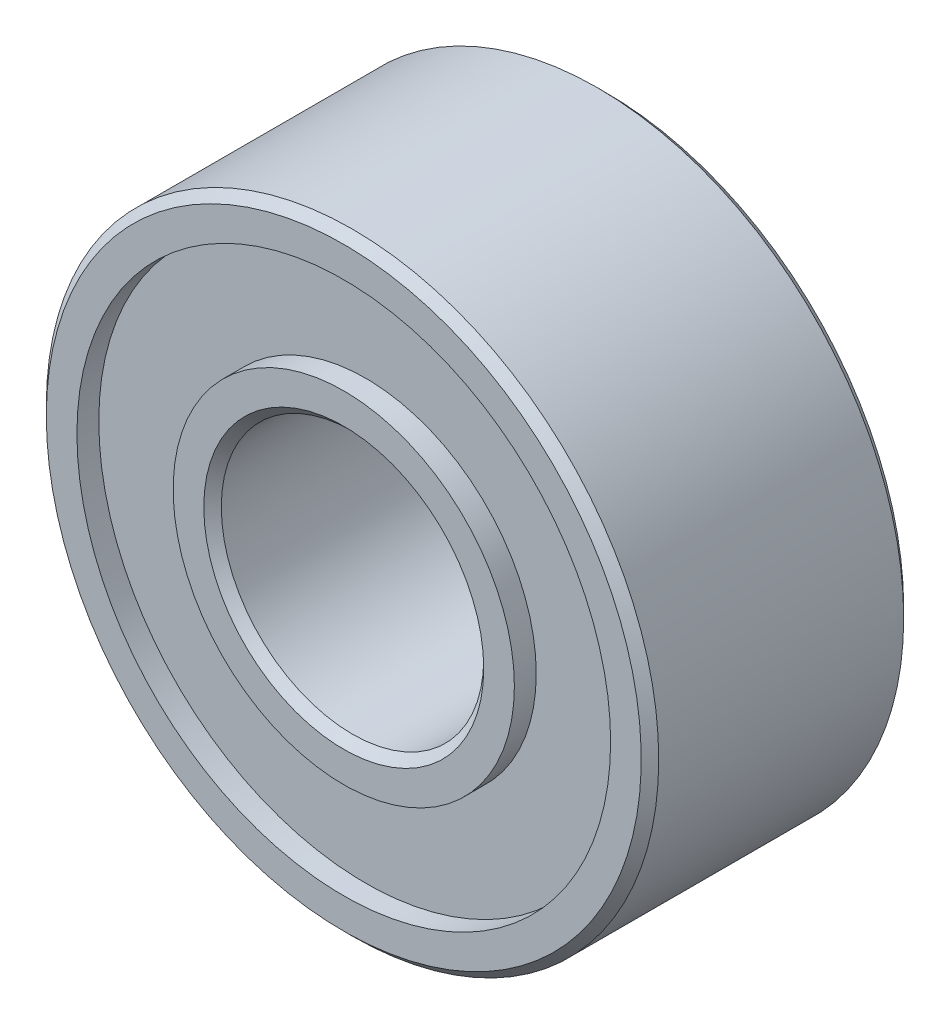
ISO-10303-21;
HEADER;
FILE_DESCRIPTION(('STEP AP214'),'2;1');
FILE_NAME('part.step','',(''),(''),'','','');
FILE_SCHEMA(('AUTOMOTIVE_DESIGN { 1 0 10303 214 1 1 1 1 }'));
ENDSEC;
DATA;
#1=APPLICATION_CONTEXT('core data for automotive mechanical design processes');
#2=APPLICATION_PROTOCOL_DEFINITION('international standard','automotive_design',2000,#1);
#3=PRODUCT_CONTEXT('',#1,'mechanical');
#4=PRODUCT('Part','Part','',(#3));
#5=PRODUCT_RELATED_PRODUCT_CATEGORY('part','',(#4));
#6=PRODUCT_DEFINITION_FORMATION('','',#4);
#7=PRODUCT_DEFINITION_CONTEXT('part definition',#1,'design');
#8=PRODUCT_DEFINITION('design','',#6,#7);
#9=PRODUCT_DEFINITION_SHAPE('','',#8);
#10=(LENGTH_UNIT() NAMED_UNIT(*) SI_UNIT(.MILLI.,.METRE.));
#11=(NAMED_UNIT(*) PLANE_ANGLE_UNIT() SI_UNIT($,.RADIAN.));
#12=(NAMED_UNIT(*) SI_UNIT($,.STERADIAN.) SOLID_ANGLE_UNIT());
#13=UNCERTAINTY_MEASURE_WITH_UNIT(LENGTH_MEASURE(1.E-05),#10,'distance_accuracy_value','');
#14=(GEOMETRIC_REPRESENTATION_CONTEXT(3) GLOBAL_UNCERTAINTY_ASSIGNED_CONTEXT((#13)) GLOBAL_UNIT_ASSIGNED_CONTEXT((#10,
#11,#12)) REPRESENTATION_CONTEXT('',''));
#15=CARTESIAN_POINT('',(0.,0.,0.));
#16=DIRECTION('',(0.,0.,1.));
#17=DIRECTION('',(1.,0.,0.));
#18=AXIS2_PLACEMENT_3D('',#15,#16,#17);
#19=CARTESIAN_POINT('',(0.,1.5,-1.5));
#20=DIRECTION('',(0.,0.,1.));
#21=DIRECTION('',(1.,0.,0.));
#22=AXIS2_PLACEMENT_3D('',#19,#20,#21);
#23=PLANE('',#22);
#24=CARTESIAN_POINT('',(0.,0.,-1.5));
#25=DIRECTION('',(0.,0.,1.));
#26=DIRECTION('',(1.,0.,0.));
#27=AXIS2_PLACEMENT_3D('',#24,#25,#26);
#28=CIRCLE('',#27,1.6);
#29=CARTESIAN_POINT('',(1.6,0.,-1.5));
#30=VERTEX_POINT('',#29);
#31=EDGE_CURVE('E66',#30,#30,#28,.T.);
#32=ORIENTED_EDGE('',*,*,#31,.T.);
#33=EDGE_LOOP('',(#32));
#34=FACE_BOUND('',#33,.T.);
#35=CARTESIAN_POINT('',(0.,0.,-1.5));
#36=DIRECTION('',(0.,0.,1.));
#37=DIRECTION('',(1.,0.,0.));
#38=AXIS2_PLACEMENT_3D('',#35,#36,#37);
#39=CIRCLE('',#38,1.95);
#40=CARTESIAN_POINT('',(1.95,0.,-1.5));
#41=VERTEX_POINT('',#40);
#42=EDGE_CURVE('E69',#41,#41,#39,.T.);
#43=ORIENTED_EDGE('',*,*,#42,.F.);
#44=EDGE_LOOP('',(#43));
#45=FACE_BOUND('',#44,.T.);
#46=ADVANCED_FACE('F37',(#34,#45),#23,.F.);
#47=CARTESIAN_POINT('',(0.,0.,11.8458465216965));
#48=DIRECTION('',(0.,0.,1.));
#49=DIRECTION('',(1.,0.,0.));
#50=AXIS2_PLACEMENT_3D('',#47,#48,#49);
#51=CYLINDRICAL_SURFACE('',#50,1.95);
#52=CARTESIAN_POINT('',(0.,0.,-1.25));
#53=DIRECTION('',(0.,0.,1.));
#54=DIRECTION('',(1.,0.,0.));
#55=AXIS2_PLACEMENT_3D('',#52,#53,#54);
#56=CIRCLE('',#55,1.95);
#57=CARTESIAN_POINT('',(1.95,0.,-1.25));
#58=VERTEX_POINT('',#57);
#59=EDGE_CURVE('E72',#58,#58,#56,.T.);
#60=ORIENTED_EDGE('',*,*,#59,.F.);
#61=EDGE_LOOP('',(#60));
#62=FACE_BOUND('',#61,.T.);
#63=ORIENTED_EDGE('',*,*,#42,.T.);
#64=EDGE_LOOP('',(#63));
#65=FACE_BOUND('',#64,.T.);
#66=ADVANCED_FACE('F125',(#62,#65),#51,.T.);
#67=CARTESIAN_POINT('',(0.,1.95,-1.25));
#68=DIRECTION('',(0.,0.,1.));
#69=DIRECTION('',(1.,0.,0.));
#70=AXIS2_PLACEMENT_3D('',#67,#68,#69);
#71=PLANE('',#70);
#72=CARTESIAN_POINT('',(0.,0.,-1.25));
#73=DIRECTION('',(0.,0.,1.));
#74=DIRECTION('',(1.,0.,0.));
#75=AXIS2_PLACEMENT_3D('',#72,#73,#74);
#76=CIRCLE('',#75,3.05);
#77=CARTESIAN_POINT('',(3.05,0.,-1.25));
#78=VERTEX_POINT('',#77);
#79=EDGE_CURVE('E75',#78,#78,#76,.T.);
#80=ORIENTED_EDGE('',*,*,#79,.F.);
#81=EDGE_LOOP('',(#80));
#82=FACE_BOUND('',#81,.T.);
#83=ORIENTED_EDGE('',*,*,#59,.T.);
#84=EDGE_LOOP('',(#83));
#85=FACE_BOUND('',#84,.T.);
#86=ADVANCED_FACE('F131',(#82,#85),#71,.F.);
#87=CARTESIAN_POINT('',(0.,0.,11.8458465216965));
#88=DIRECTION('',(0.,0.,1.));
#89=DIRECTION('',(1.,0.,0.));
#90=AXIS2_PLACEMENT_3D('',#87,#88,#89);
#91=CYLINDRICAL_SURFACE('',#90,3.05);
#92=CARTESIAN_POINT('',(0.,0.,-1.5));
#93=DIRECTION('',(0.,0.,1.));
#94=DIRECTION('',(1.,0.,0.));
#95=AXIS2_PLACEMENT_3D('',#92,#93,#94);
#96=CIRCLE('',#95,3.05);
#97=CARTESIAN_POINT('',(3.05,0.,-1.5));
#98=VERTEX_POINT('',#97);
#99=EDGE_CURVE('E78',#98,#98,#96,.T.);
#100=ORIENTED_EDGE('',*,*,#99,.F.);
#101=EDGE_LOOP('',(#100));
#102=FACE_BOUND('',#101,.T.);
#103=ORIENTED_EDGE('',*,*,#79,.T.);
#104=EDGE_LOOP('',(#103));
#105=FACE_BOUND('',#104,.T.);
#106=ADVANCED_FACE('F221',(#102,#105),#91,.F.);
#107=CARTESIAN_POINT('',(0.,3.05,-1.5));
#108=DIRECTION('',(0.,0.,1.));
#109=DIRECTION('',(1.,0.,0.));
#110=AXIS2_PLACEMENT_3D('',#107,#108,#109);
#111=PLANE('',#110);
#112=CARTESIAN_POINT('',(0.,0.,-1.5));
#113=DIRECTION('',(0.,0.,1.));
#114=DIRECTION('',(1.,0.,0.));
#115=AXIS2_PLACEMENT_3D('',#112,#113,#114);
#116=CIRCLE('',#115,3.4);
#117=CARTESIAN_POINT('',(3.4,0.,-1.5));
#118=VERTEX_POINT('',#117);
#119=EDGE_CURVE('E44',#118,#118,#116,.F.);
#120=ORIENTED_EDGE('',*,*,#119,.T.);
#121=EDGE_LOOP('',(#120));
#122=FACE_BOUND('',#121,.T.);
#123=ORIENTED_EDGE('',*,*,#99,.T.);
#124=EDGE_LOOP('',(#123));
#125=FACE_BOUND('',#124,.T.);
#126=ADVANCED_FACE('F121',(#122,#125),#111,.F.);
#127=CARTESIAN_POINT('',(0.,0.,11.8458465216965));
#128=DIRECTION('',(0.,0.,1.));
#129=DIRECTION('',(1.,0.,0.));
#130=AXIS2_PLACEMENT_3D('',#127,#128,#129);
#131=CYLINDRICAL_SURFACE('',#130,3.5);
#132=CARTESIAN_POINT('',(0.,0.,-1.4));
#133=DIRECTION('',(0.,0.,1.));
#134=DIRECTION('',(1.,0.,0.));
#135=AXIS2_PLACEMENT_3D('',#132,#133,#134);
#136=CIRCLE('',#135,3.5);
#137=CARTESIAN_POINT('',(3.5,0.,-1.4));
#138=VERTEX_POINT('',#137);
#139=EDGE_CURVE('E48',#138,#138,#136,.T.);
#140=ORIENTED_EDGE('',*,*,#139,.T.);
#141=EDGE_LOOP('',(#140));
#142=FACE_BOUND('',#141,.T.);
#143=CARTESIAN_POINT('',(0.,0.,1.39999999999999));
#144=DIRECTION('',(0.,0.,-1.));
#145=DIRECTION('',(-1.,0.,0.));
#146=AXIS2_PLACEMENT_3D('',#143,#144,#145);
#147=CIRCLE('',#146,3.5);
#148=CARTESIAN_POINT('',(-3.5,0.,1.39999999999999));
#149=VERTEX_POINT('',#148);
#150=EDGE_CURVE('E52',#149,#149,#147,.T.);
#151=ORIENTED_EDGE('',*,*,#150,.T.);
#152=EDGE_LOOP('',(#151));
#153=FACE_BOUND('',#152,.T.);
#154=ADVANCED_FACE('F116',(#142,#153),#131,.T.);
#155=CARTESIAN_POINT('',(0.,3.05,1.5));
#156=DIRECTION('',(0.,0.,-1.));
#157=DIRECTION('',(-1.,0.,0.));
#158=AXIS2_PLACEMENT_3D('',#155,#156,#157);
#159=PLANE('',#158);
#160=CARTESIAN_POINT('',(0.,0.,1.5));
#161=DIRECTION('',(0.,0.,-1.));
#162=DIRECTION('',(-1.,0.,0.));
#163=AXIS2_PLACEMENT_3D('',#160,#161,#162);
#164=CIRCLE('',#163,3.4);
#165=CARTESIAN_POINT('',(-3.4,0.,1.5));
#166=VERTEX_POINT('',#165);
#167=EDGE_CURVE('E10',#166,#166,#164,.F.);
#168=ORIENTED_EDGE('',*,*,#167,.T.);
#169=EDGE_LOOP('',(#168));
#170=FACE_BOUND('',#169,.T.);
#171=CARTESIAN_POINT('',(0.,0.,1.5));
#172=DIRECTION('',(0.,0.,1.));
#173=DIRECTION('',(1.,0.,0.));
#174=AXIS2_PLACEMENT_3D('',#171,#172,#173);
#175=CIRCLE('',#174,3.05);
#176=CARTESIAN_POINT('',(3.05,0.,1.5));
#177=VERTEX_POINT('',#176);
#178=EDGE_CURVE('E81',#177,#177,#175,.T.);
#179=ORIENTED_EDGE('',*,*,#178,.F.);
#180=EDGE_LOOP('',(#179));
#181=FACE_BOUND('',#180,.T.);
#182=ADVANCED_FACE('F111',(#170,#181),#159,.F.);
#183=CARTESIAN_POINT('',(0.,0.,11.8458465216965));
#184=DIRECTION('',(0.,0.,1.));
#185=DIRECTION('',(1.,0.,0.));
#186=AXIS2_PLACEMENT_3D('',#183,#184,#185);
#187=CYLINDRICAL_SURFACE('',#186,3.05);
#188=CARTESIAN_POINT('',(0.,0.,1.25));
#189=DIRECTION('',(0.,0.,1.));
#190=DIRECTION('',(1.,0.,0.));
#191=AXIS2_PLACEMENT_3D('',#188,#189,#190);
#192=CIRCLE('',#191,3.05);
#193=CARTESIAN_POINT('',(3.05,0.,1.25));
#194=VERTEX_POINT('',#193);
#195=EDGE_CURVE('E84',#194,#194,#192,.T.);
#196=ORIENTED_EDGE('',*,*,#195,.F.);
#197=EDGE_LOOP('',(#196));
#198=FACE_BOUND('',#197,.T.);
#199=ORIENTED_EDGE('',*,*,#178,.T.);
#200=EDGE_LOOP('',(#199));
#201=FACE_BOUND('',#200,.T.);
#202=ADVANCED_FACE('F105',(#198,#201),#187,.F.);
#203=CARTESIAN_POINT('',(0.,1.95,1.25));
#204=DIRECTION('',(0.,0.,-1.));
#205=DIRECTION('',(-1.,0.,0.));
#206=AXIS2_PLACEMENT_3D('',#203,#204,#205);
#207=PLANE('',#206);
#208=CARTESIAN_POINT('',(0.,0.,1.25));
#209=DIRECTION('',(0.,0.,1.));
#210=DIRECTION('',(1.,0.,0.));
#211=AXIS2_PLACEMENT_3D('',#208,#209,#210);
#212=CIRCLE('',#211,1.95);
#213=CARTESIAN_POINT('',(1.95,0.,1.25));
#214=VERTEX_POINT('',#213);
#215=EDGE_CURVE('E87',#214,#214,#212,.T.);
#216=ORIENTED_EDGE('',*,*,#215,.F.);
#217=EDGE_LOOP('',(#216));
#218=FACE_BOUND('',#217,.T.);
#219=ORIENTED_EDGE('',*,*,#195,.T.);
#220=EDGE_LOOP('',(#219));
#221=FACE_BOUND('',#220,.T.);
#222=ADVANCED_FACE('F99',(#218,#221),#207,.F.);
#223=CARTESIAN_POINT('',(0.,0.,11.8458465216965));
#224=DIRECTION('',(0.,0.,1.));
#225=DIRECTION('',(1.,0.,0.));
#226=AXIS2_PLACEMENT_3D('',#223,#224,#225);
#227=CYLINDRICAL_SURFACE('',#226,1.95);
#228=CARTESIAN_POINT('',(0.,0.,1.5));
#229=DIRECTION('',(0.,0.,1.));
#230=DIRECTION('',(1.,0.,0.));
#231=AXIS2_PLACEMENT_3D('',#228,#229,#230);
#232=CIRCLE('',#231,1.95);
#233=CARTESIAN_POINT('',(1.95,0.,1.5));
#234=VERTEX_POINT('',#233);
#235=EDGE_CURVE('E90',#234,#234,#232,.T.);
#236=ORIENTED_EDGE('',*,*,#235,.F.);
#237=EDGE_LOOP('',(#236));
#238=FACE_BOUND('',#237,.T.);
#239=ORIENTED_EDGE('',*,*,#215,.T.);
#240=EDGE_LOOP('',(#239));
#241=FACE_BOUND('',#240,.T.);
#242=ADVANCED_FACE('F96',(#238,#241),#227,.T.);
#243=CARTESIAN_POINT('',(0.,1.5,1.5));
#244=DIRECTION('',(0.,0.,-1.));
#245=DIRECTION('',(-1.,0.,0.));
#246=AXIS2_PLACEMENT_3D('',#243,#244,#245);
#247=PLANE('',#246);
#248=CARTESIAN_POINT('',(0.,0.,1.5));
#249=DIRECTION('',(0.,0.,-1.));
#250=DIRECTION('',(-1.,0.,0.));
#251=AXIS2_PLACEMENT_3D('',#248,#249,#250);
#252=CIRCLE('',#251,1.6);
#253=CARTESIAN_POINT('',(-1.6,0.,1.5));
#254=VERTEX_POINT('',#253);
#255=EDGE_CURVE('E57',#254,#254,#252,.T.);
#256=ORIENTED_EDGE('',*,*,#255,.T.);
#257=EDGE_LOOP('',(#256));
#258=FACE_BOUND('',#257,.T.);
#259=ORIENTED_EDGE('',*,*,#235,.T.);
#260=EDGE_LOOP('',(#259));
#261=FACE_BOUND('',#260,.T.);
#262=ADVANCED_FACE('F94',(#258,#261),#247,.F.);
#263=CARTESIAN_POINT('',(0.,0.,11.8458465216965));
#264=DIRECTION('',(0.,0.,1.));
#265=DIRECTION('',(1.,0.,0.));
#266=AXIS2_PLACEMENT_3D('',#263,#264,#265);
#267=CYLINDRICAL_SURFACE('',#266,1.5);
#268=CARTESIAN_POINT('',(0.,0.,-1.4));
#269=DIRECTION('',(0.,0.,1.));
#270=DIRECTION('',(1.,0.,0.));
#271=AXIS2_PLACEMENT_3D('',#268,#269,#270);
#272=CIRCLE('',#271,1.5);
#273=CARTESIAN_POINT('',(1.5,0.,-1.4));
#274=VERTEX_POINT('',#273);
#275=EDGE_CURVE('E60',#274,#274,#272,.F.);
#276=ORIENTED_EDGE('',*,*,#275,.T.);
#277=EDGE_LOOP('',(#276));
#278=FACE_BOUND('',#277,.T.);
#279=CARTESIAN_POINT('',(0.,0.,1.4));
#280=DIRECTION('',(0.,0.,-1.));
#281=DIRECTION('',(-1.,0.,0.));
#282=AXIS2_PLACEMENT_3D('',#279,#280,#281);
#283=CIRCLE('',#282,1.5);
#284=CARTESIAN_POINT('',(-1.5,0.,1.4));
#285=VERTEX_POINT('',#284);
#286=EDGE_CURVE('E63',#285,#285,#283,.F.);
#287=ORIENTED_EDGE('',*,*,#286,.T.);
#288=EDGE_LOOP('',(#287));
#289=FACE_BOUND('',#288,.T.);
#290=ADVANCED_FACE('F141',(#278,#289),#267,.F.);
#291=CARTESIAN_POINT('',(0.,0.,-1.5));
#292=DIRECTION('',(0.,0.,-1.));
#293=DIRECTION('',(-1.,0.,0.));
#294=AXIS2_PLACEMENT_3D('',#291,#292,#293);
#295=CONICAL_SURFACE('',#294,1.6,0.785398163397438);
#296=ORIENTED_EDGE('',*,*,#275,.F.);
#297=EDGE_LOOP('',(#296));
#298=FACE_BOUND('',#297,.T.);
#299=ORIENTED_EDGE('',*,*,#31,.F.);
#300=EDGE_LOOP('',(#299));
#301=FACE_BOUND('',#300,.T.);
#302=ADVANCED_FACE('F137',(#298,#301),#295,.F.);
#303=CARTESIAN_POINT('',(0.,0.,1.4));
#304=DIRECTION('',(0.,0.,1.));
#305=DIRECTION('',(1.,0.,0.));
#306=AXIS2_PLACEMENT_3D('',#303,#304,#305);
#307=CONICAL_SURFACE('',#306,1.5,0.785398163397446);
#308=ORIENTED_EDGE('',*,*,#255,.F.);
#309=EDGE_LOOP('',(#308));
#310=FACE_BOUND('',#309,.T.);
#311=ORIENTED_EDGE('',*,*,#286,.F.);
#312=EDGE_LOOP('',(#311));
#313=FACE_BOUND('',#312,.T.);
#314=ADVANCED_FACE('F140',(#310,#313),#307,.F.);
#315=CARTESIAN_POINT('',(0.,0.,-1.4));
#316=DIRECTION('',(0.,0.,1.));
#317=DIRECTION('',(1.,0.,0.));
#318=AXIS2_PLACEMENT_3D('',#315,#316,#317);
#319=CONICAL_SURFACE('',#318,3.5,0.785398163397448);
#320=ORIENTED_EDGE('',*,*,#119,.F.);
#321=EDGE_LOOP('',(#320));
#322=FACE_BOUND('',#321,.T.);
#323=ORIENTED_EDGE('',*,*,#139,.F.);
#324=EDGE_LOOP('',(#323));
#325=FACE_BOUND('',#324,.T.);
#326=ADVANCED_FACE('F144',(#322,#325),#319,.T.);
#327=CARTESIAN_POINT('',(0.,0.,1.5));
#328=DIRECTION('',(0.,0.,-1.));
#329=DIRECTION('',(-1.,0.,0.));
#330=AXIS2_PLACEMENT_3D('',#327,#328,#329);
#331=CONICAL_SURFACE('',#330,3.4,0.785398163397446);
#332=ORIENTED_EDGE('',*,*,#150,.F.);
#333=EDGE_LOOP('',(#332));
#334=FACE_BOUND('',#333,.T.);
#335=ORIENTED_EDGE('',*,*,#167,.F.);
#336=EDGE_LOOP('',(#335));
#337=FACE_BOUND('',#336,.T.);
#338=ADVANCED_FACE('F39',(#334,#337),#331,.T.);
#339=CLOSED_SHELL('',(#46,#66,#86,#106,#126,#154,#182,#202,#222,#242,#262,#290,#302,#314,#326,#338));
#340=MANIFOLD_SOLID_BREP('B2',#339);
#341=ADVANCED_BREP_SHAPE_REPRESENTATION('',(#18,#340),#14);
#342=SHAPE_DEFINITION_REPRESENTATION(#9,#341);
ENDSEC;
END-ISO-10303-21;
